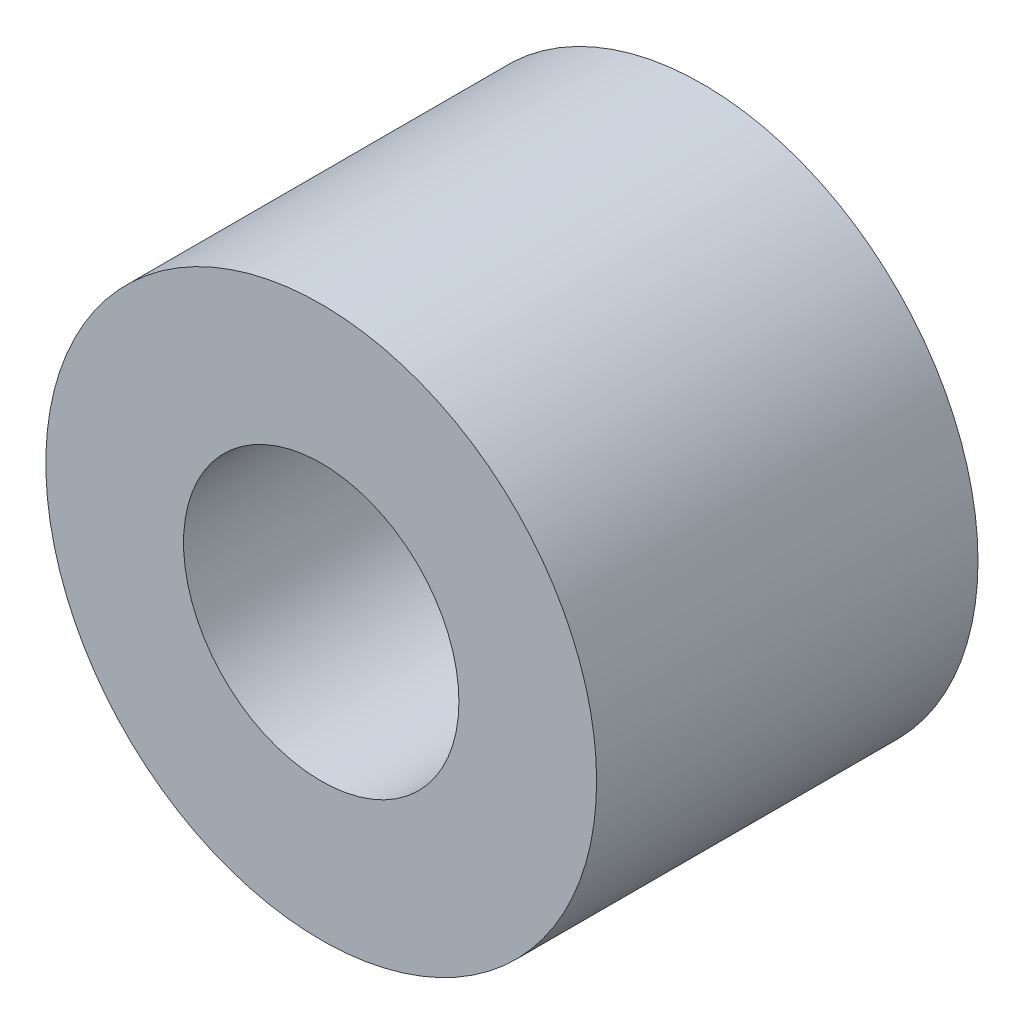
ISO-10303-21;
HEADER;
FILE_DESCRIPTION(('STEP AP214'),'2;1');
FILE_NAME('part.step','',(''),(''),'','','');
FILE_SCHEMA(('AUTOMOTIVE_DESIGN { 1 0 10303 214 1 1 1 1 }'));
ENDSEC;
DATA;
#1=APPLICATION_CONTEXT('core data for automotive mechanical design processes');
#2=APPLICATION_PROTOCOL_DEFINITION('international standard','automotive_design',2000,#1);
#3=PRODUCT_CONTEXT('',#1,'mechanical');
#4=PRODUCT('Part','Part','',(#3));
#5=PRODUCT_RELATED_PRODUCT_CATEGORY('part','',(#4));
#6=PRODUCT_DEFINITION_FORMATION('','',#4);
#7=PRODUCT_DEFINITION_CONTEXT('part definition',#1,'design');
#8=PRODUCT_DEFINITION('design','',#6,#7);
#9=PRODUCT_DEFINITION_SHAPE('','',#8);
#10=(LENGTH_UNIT() NAMED_UNIT(*) SI_UNIT(.MILLI.,.METRE.));
#11=(NAMED_UNIT(*) PLANE_ANGLE_UNIT() SI_UNIT($,.RADIAN.));
#12=(NAMED_UNIT(*) SI_UNIT($,.STERADIAN.) SOLID_ANGLE_UNIT());
#13=UNCERTAINTY_MEASURE_WITH_UNIT(LENGTH_MEASURE(1.E-05),#10,'distance_accuracy_value','');
#14=(GEOMETRIC_REPRESENTATION_CONTEXT(3) GLOBAL_UNCERTAINTY_ASSIGNED_CONTEXT((#13)) GLOBAL_UNIT_ASSIGNED_CONTEXT((#10,
#11,#12)) REPRESENTATION_CONTEXT('',''));
#15=CARTESIAN_POINT('',(0.,0.,0.));
#16=DIRECTION('',(0.,0.,1.));
#17=DIRECTION('',(1.,0.,0.));
#18=AXIS2_PLACEMENT_3D('',#15,#16,#17);
#19=CARTESIAN_POINT('',(0.,0.,8.793740604));
#20=DIRECTION('',(0.,0.,1.));
#21=DIRECTION('',(1.,0.,0.));
#22=AXIS2_PLACEMENT_3D('',#19,#20,#21);
#23=PLANE('',#22);
#24=CARTESIAN_POINT('',(0.,0.,8.793740604));
#25=DIRECTION('',(0.,0.,1.));
#26=DIRECTION('',(1.,0.,0.));
#27=AXIS2_PLACEMENT_3D('',#24,#25,#26);
#28=CIRCLE('',#27,6.35);
#29=CARTESIAN_POINT('',(6.35,0.,8.793740604));
#30=VERTEX_POINT('',#29);
#31=EDGE_CURVE('E10',#30,#30,#28,.T.);
#32=ORIENTED_EDGE('',*,*,#31,.T.);
#33=EDGE_LOOP('',(#32));
#34=FACE_BOUND('',#33,.T.);
#35=CARTESIAN_POINT('',(0.,0.,8.793740604));
#36=DIRECTION('',(0.,0.,1.));
#37=DIRECTION('',(1.,0.,0.));
#38=AXIS2_PLACEMENT_3D('',#35,#36,#37);
#39=CIRCLE('',#38,3.175);
#40=CARTESIAN_POINT('',(3.175,0.,8.793740604));
#41=VERTEX_POINT('',#40);
#42=EDGE_CURVE('E42',#41,#41,#39,.T.);
#43=ORIENTED_EDGE('',*,*,#42,.F.);
#44=EDGE_LOOP('',(#43));
#45=FACE_BOUND('',#44,.T.);
#46=ADVANCED_FACE('F31',(#34,#45),#23,.T.);
#47=CARTESIAN_POINT('',(0.,0.,0.));
#48=DIRECTION('',(0.,0.,1.));
#49=DIRECTION('',(1.,0.,0.));
#50=AXIS2_PLACEMENT_3D('',#47,#48,#49);
#51=PLANE('',#50);
#52=CARTESIAN_POINT('',(0.,0.,0.));
#53=DIRECTION('',(0.,0.,1.));
#54=DIRECTION('',(1.,0.,0.));
#55=AXIS2_PLACEMENT_3D('',#52,#53,#54);
#56=CIRCLE('',#55,6.35);
#57=CARTESIAN_POINT('',(6.35,0.,0.));
#58=VERTEX_POINT('',#57);
#59=EDGE_CURVE('E35',#58,#58,#56,.T.);
#60=ORIENTED_EDGE('',*,*,#59,.F.);
#61=EDGE_LOOP('',(#60));
#62=FACE_BOUND('',#61,.T.);
#63=CARTESIAN_POINT('',(0.,0.,0.));
#64=DIRECTION('',(0.,0.,1.));
#65=DIRECTION('',(1.,0.,0.));
#66=AXIS2_PLACEMENT_3D('',#63,#64,#65);
#67=CIRCLE('',#66,3.175);
#68=CARTESIAN_POINT('',(3.175,0.,0.));
#69=VERTEX_POINT('',#68);
#70=EDGE_CURVE('E44',#69,#69,#67,.T.);
#71=ORIENTED_EDGE('',*,*,#70,.T.);
#72=EDGE_LOOP('',(#71));
#73=FACE_BOUND('',#72,.T.);
#74=ADVANCED_FACE('F54',(#62,#73),#51,.F.);
#75=CARTESIAN_POINT('',(0.,0.,8.793740604));
#76=DIRECTION('',(0.,0.,-1.));
#77=DIRECTION('',(-1.,0.,0.));
#78=AXIS2_PLACEMENT_3D('',#75,#76,#77);
#79=CYLINDRICAL_SURFACE('',#78,6.35);
#80=ORIENTED_EDGE('',*,*,#31,.F.);
#81=EDGE_LOOP('',(#80));
#82=FACE_BOUND('',#81,.T.);
#83=ORIENTED_EDGE('',*,*,#59,.T.);
#84=EDGE_LOOP('',(#83));
#85=FACE_BOUND('',#84,.T.);
#86=ADVANCED_FACE('F33',(#82,#85),#79,.T.);
#87=CARTESIAN_POINT('',(0.,0.,8.793740604));
#88=DIRECTION('',(0.,0.,-1.));
#89=DIRECTION('',(-1.,0.,0.));
#90=AXIS2_PLACEMENT_3D('',#87,#88,#89);
#91=CYLINDRICAL_SURFACE('',#90,3.175);
#92=ORIENTED_EDGE('',*,*,#42,.T.);
#93=EDGE_LOOP('',(#92));
#94=FACE_BOUND('',#93,.T.);
#95=ORIENTED_EDGE('',*,*,#70,.F.);
#96=EDGE_LOOP('',(#95));
#97=FACE_BOUND('',#96,.T.);
#98=ADVANCED_FACE('F50',(#94,#97),#91,.F.);
#99=CLOSED_SHELL('',(#46,#74,#86,#98));
#100=MANIFOLD_SOLID_BREP('B2',#99);
#101=ADVANCED_BREP_SHAPE_REPRESENTATION('',(#18,#100),#14);
#102=SHAPE_DEFINITION_REPRESENTATION(#9,#101);
ENDSEC;
END-ISO-10303-21;
